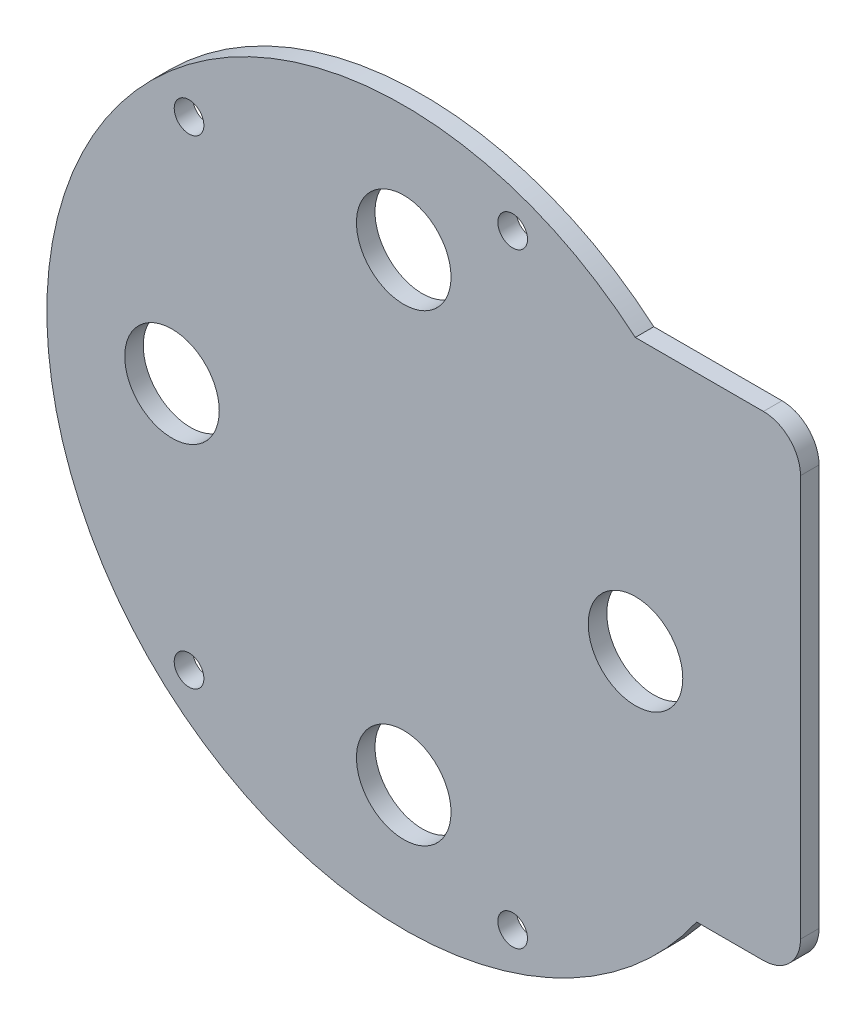
ISO-10303-21;
HEADER;
FILE_DESCRIPTION(('STEP AP214'),'2;1');
FILE_NAME('part.step','',(''),(''),'','','');
FILE_SCHEMA(('AUTOMOTIVE_DESIGN { 1 0 10303 214 1 1 1 1 }'));
ENDSEC;
DATA;
#1=APPLICATION_CONTEXT('core data for automotive mechanical design processes');
#2=APPLICATION_PROTOCOL_DEFINITION('international standard','automotive_design',2000,#1);
#3=PRODUCT_CONTEXT('',#1,'mechanical');
#4=PRODUCT('Part','Part','',(#3));
#5=PRODUCT_RELATED_PRODUCT_CATEGORY('part','',(#4));
#6=PRODUCT_DEFINITION_FORMATION('','',#4);
#7=PRODUCT_DEFINITION_CONTEXT('part definition',#1,'design');
#8=PRODUCT_DEFINITION('design','',#6,#7);
#9=PRODUCT_DEFINITION_SHAPE('','',#8);
#10=(LENGTH_UNIT() NAMED_UNIT(*) SI_UNIT(.MILLI.,.METRE.));
#11=(NAMED_UNIT(*) PLANE_ANGLE_UNIT() SI_UNIT($,.RADIAN.));
#12=(NAMED_UNIT(*) SI_UNIT($,.STERADIAN.) SOLID_ANGLE_UNIT());
#13=UNCERTAINTY_MEASURE_WITH_UNIT(LENGTH_MEASURE(1.E-05),#10,'distance_accuracy_value','');
#14=(GEOMETRIC_REPRESENTATION_CONTEXT(3) GLOBAL_UNCERTAINTY_ASSIGNED_CONTEXT((#13)) GLOBAL_UNIT_ASSIGNED_CONTEXT((#10,
#11,#12)) REPRESENTATION_CONTEXT('',''));
#15=CARTESIAN_POINT('',(0.,0.,0.));
#16=DIRECTION('',(0.,0.,1.));
#17=DIRECTION('',(1.,0.,0.));
#18=AXIS2_PLACEMENT_3D('',#15,#16,#17);
#19=CARTESIAN_POINT('',(0.,0.,2.));
#20=DIRECTION('',(0.,0.,1.));
#21=DIRECTION('',(1.,0.,0.));
#22=AXIS2_PLACEMENT_3D('',#19,#20,#21);
#23=PLANE('',#22);
#24=CARTESIAN_POINT('',(0.,25.,2.));
#25=DIRECTION('',(0.,0.,1.));
#26=DIRECTION('',(1.,0.,0.));
#27=AXIS2_PLACEMENT_3D('',#24,#25,#26);
#28=CIRCLE('',#27,5.1);
#29=CARTESIAN_POINT('',(5.09999999999999,25.,2.));
#30=VERTEX_POINT('',#29);
#31=EDGE_CURVE('E179',#30,#30,#28,.T.);
#32=ORIENTED_EDGE('',*,*,#31,.F.);
#33=EDGE_LOOP('',(#32));
#34=FACE_BOUND('',#33,.T.);
#35=CARTESIAN_POINT('',(0.,-25.,2.));
#36=DIRECTION('',(0.,0.,1.));
#37=DIRECTION('',(1.,0.,0.));
#38=AXIS2_PLACEMENT_3D('',#35,#36,#37);
#39=CIRCLE('',#38,5.1);
#40=CARTESIAN_POINT('',(5.10000000000001,-25.,2.));
#41=VERTEX_POINT('',#40);
#42=EDGE_CURVE('E167',#41,#41,#39,.T.);
#43=ORIENTED_EDGE('',*,*,#42,.F.);
#44=EDGE_LOOP('',(#43));
#45=FACE_BOUND('',#44,.T.);
#46=CARTESIAN_POINT('',(11.7502127640311,32.65,2.));
#47=DIRECTION('',(0.,0.,1.));
#48=DIRECTION('',(-1.,0.,0.));
#49=AXIS2_PLACEMENT_3D('',#46,#47,#48);
#50=CIRCLE('',#49,1.6);
#51=CARTESIAN_POINT('',(10.1502127640311,32.65,2.));
#52=VERTEX_POINT('',#51);
#53=EDGE_CURVE('E155',#52,#52,#50,.T.);
#54=ORIENTED_EDGE('',*,*,#53,.F.);
#55=EDGE_LOOP('',(#54));
#56=FACE_BOUND('',#55,.T.);
#57=CARTESIAN_POINT('',(-23.1599740932498,-25.84,2.));
#58=DIRECTION('',(0.,0.,1.));
#59=DIRECTION('',(1.,0.,0.));
#60=AXIS2_PLACEMENT_3D('',#57,#58,#59);
#61=CIRCLE('',#60,1.6);
#62=CARTESIAN_POINT('',(-21.5599740932498,-25.84,2.));
#63=VERTEX_POINT('',#62);
#64=EDGE_CURVE('E143',#63,#63,#61,.T.);
#65=ORIENTED_EDGE('',*,*,#64,.F.);
#66=EDGE_LOOP('',(#65));
#67=FACE_BOUND('',#66,.T.);
#68=DIRECTION('',(0.,1.,0.));
#69=VECTOR('',#68,1.);
#70=CARTESIAN_POINT('',(42.8,29.3,2.));
#71=LINE('',#70,#69);
#72=CARTESIAN_POINT('',(42.8,-18.,2.));
#73=VERTEX_POINT('',#72);
#74=CARTESIAN_POINT('',(42.8,25.3,2.));
#75=VERTEX_POINT('',#74);
#76=EDGE_CURVE('E92',#73,#75,#71,.T.);
#77=ORIENTED_EDGE('',*,*,#76,.T.);
#78=CARTESIAN_POINT('',(38.8,25.3,2.));
#79=DIRECTION('',(0.,0.,1.));
#80=DIRECTION('',(1.,0.,0.));
#81=AXIS2_PLACEMENT_3D('',#78,#79,#80);
#82=CIRCLE('',#81,4.);
#83=CARTESIAN_POINT('',(38.8,29.3,2.));
#84=VERTEX_POINT('',#83);
#85=EDGE_CURVE('E40',#75,#84,#82,.T.);
#86=ORIENTED_EDGE('',*,*,#85,.T.);
#87=DIRECTION('',(-1.,0.,0.));
#88=VECTOR('',#87,1.);
#89=CARTESIAN_POINT('',(24.9751876869825,29.3,2.));
#90=LINE('',#89,#88);
#91=CARTESIAN_POINT('',(24.9751876869825,29.3,2.));
#92=VERTEX_POINT('',#91);
#93=EDGE_CURVE('E98',#84,#92,#90,.T.);
#94=ORIENTED_EDGE('',*,*,#93,.T.);
#95=CARTESIAN_POINT('',(0.,0.,2.));
#96=DIRECTION('',(0.,0.,1.));
#97=DIRECTION('',(1.,0.,0.));
#98=AXIS2_PLACEMENT_3D('',#95,#96,#97);
#99=CIRCLE('',#98,38.5);
#100=CARTESIAN_POINT('',(31.5950945559592,-22.,2.));
#101=VERTEX_POINT('',#100);
#102=EDGE_CURVE('E93',#92,#101,#99,.T.);
#103=ORIENTED_EDGE('',*,*,#102,.T.);
#104=DIRECTION('',(1.,0.,0.));
#105=VECTOR('',#104,1.);
#106=CARTESIAN_POINT('',(42.8,-22.,2.));
#107=LINE('',#106,#105);
#108=CARTESIAN_POINT('',(38.8,-22.,2.));
#109=VERTEX_POINT('',#108);
#110=EDGE_CURVE('E84',#101,#109,#107,.T.);
#111=ORIENTED_EDGE('',*,*,#110,.T.);
#112=CARTESIAN_POINT('',(38.8,-18.,2.));
#113=DIRECTION('',(0.,0.,1.));
#114=DIRECTION('',(1.,0.,0.));
#115=AXIS2_PLACEMENT_3D('',#112,#113,#114);
#116=CIRCLE('',#115,4.);
#117=EDGE_CURVE('E123',#109,#73,#116,.T.);
#118=ORIENTED_EDGE('',*,*,#117,.T.);
#119=EDGE_LOOP('',(#77,#86,#94,#103,#111,#118));
#120=FACE_BOUND('',#119,.T.);
#121=CARTESIAN_POINT('',(11.7502127640311,-32.65,2.));
#122=DIRECTION('',(0.,0.,1.));
#123=DIRECTION('',(1.,0.,0.));
#124=AXIS2_PLACEMENT_3D('',#121,#122,#123);
#125=CIRCLE('',#124,1.6);
#126=CARTESIAN_POINT('',(13.3502127640311,-32.65,2.));
#127=VERTEX_POINT('',#126);
#128=EDGE_CURVE('E149',#127,#127,#125,.T.);
#129=ORIENTED_EDGE('',*,*,#128,.F.);
#130=EDGE_LOOP('',(#129));
#131=FACE_BOUND('',#130,.T.);
#132=CARTESIAN_POINT('',(-23.1599740932498,25.84,2.));
#133=DIRECTION('',(0.,0.,1.));
#134=DIRECTION('',(-1.,0.,0.));
#135=AXIS2_PLACEMENT_3D('',#132,#133,#134);
#136=CIRCLE('',#135,1.6);
#137=CARTESIAN_POINT('',(-24.7599740932498,25.84,2.));
#138=VERTEX_POINT('',#137);
#139=EDGE_CURVE('E161',#138,#138,#136,.T.);
#140=ORIENTED_EDGE('',*,*,#139,.F.);
#141=EDGE_LOOP('',(#140));
#142=FACE_BOUND('',#141,.T.);
#143=CARTESIAN_POINT('',(-25.,0.,2.));
#144=DIRECTION('',(0.,0.,1.));
#145=DIRECTION('',(1.,0.,0.));
#146=AXIS2_PLACEMENT_3D('',#143,#144,#145);
#147=CIRCLE('',#146,5.1);
#148=CARTESIAN_POINT('',(-19.9,0.,2.));
#149=VERTEX_POINT('',#148);
#150=EDGE_CURVE('E173',#149,#149,#147,.T.);
#151=ORIENTED_EDGE('',*,*,#150,.F.);
#152=EDGE_LOOP('',(#151));
#153=FACE_BOUND('',#152,.T.);
#154=CARTESIAN_POINT('',(25.,0.,2.));
#155=DIRECTION('',(0.,0.,1.));
#156=DIRECTION('',(1.,0.,0.));
#157=AXIS2_PLACEMENT_3D('',#154,#155,#156);
#158=CIRCLE('',#157,5.1);
#159=CARTESIAN_POINT('',(30.1,0.,2.));
#160=VERTEX_POINT('',#159);
#161=EDGE_CURVE('E185',#160,#160,#158,.T.);
#162=ORIENTED_EDGE('',*,*,#161,.F.);
#163=EDGE_LOOP('',(#162));
#164=FACE_BOUND('',#163,.T.);
#165=ADVANCED_FACE('F32',(#34,#45,#56,#67,#120,#131,#142,#153,#164),#23,.T.);
#166=CARTESIAN_POINT('',(0.,0.,0.));
#167=DIRECTION('',(0.,0.,1.));
#168=DIRECTION('',(1.,0.,0.));
#169=AXIS2_PLACEMENT_3D('',#166,#167,#168);
#170=PLANE('',#169);
#171=CARTESIAN_POINT('',(0.,25.,0.));
#172=DIRECTION('',(0.,0.,1.));
#173=DIRECTION('',(1.,0.,0.));
#174=AXIS2_PLACEMENT_3D('',#171,#172,#173);
#175=CIRCLE('',#174,5.1);
#176=CARTESIAN_POINT('',(5.09999999999999,25.,0.));
#177=VERTEX_POINT('',#176);
#178=EDGE_CURVE('E182',#177,#177,#175,.T.);
#179=ORIENTED_EDGE('',*,*,#178,.T.);
#180=EDGE_LOOP('',(#179));
#181=FACE_BOUND('',#180,.T.);
#182=CARTESIAN_POINT('',(0.,-25.,0.));
#183=DIRECTION('',(0.,0.,1.));
#184=DIRECTION('',(1.,0.,0.));
#185=AXIS2_PLACEMENT_3D('',#182,#183,#184);
#186=CIRCLE('',#185,5.1);
#187=CARTESIAN_POINT('',(5.10000000000001,-25.,0.));
#188=VERTEX_POINT('',#187);
#189=EDGE_CURVE('E170',#188,#188,#186,.T.);
#190=ORIENTED_EDGE('',*,*,#189,.T.);
#191=EDGE_LOOP('',(#190));
#192=FACE_BOUND('',#191,.T.);
#193=CARTESIAN_POINT('',(11.7502127640311,32.65,0.));
#194=DIRECTION('',(0.,0.,1.));
#195=DIRECTION('',(-1.,0.,0.));
#196=AXIS2_PLACEMENT_3D('',#193,#194,#195);
#197=CIRCLE('',#196,1.6);
#198=CARTESIAN_POINT('',(10.1502127640311,32.65,0.));
#199=VERTEX_POINT('',#198);
#200=EDGE_CURVE('E158',#199,#199,#197,.T.);
#201=ORIENTED_EDGE('',*,*,#200,.T.);
#202=EDGE_LOOP('',(#201));
#203=FACE_BOUND('',#202,.T.);
#204=CARTESIAN_POINT('',(-23.1599740932498,-25.84,0.));
#205=DIRECTION('',(0.,0.,1.));
#206=DIRECTION('',(1.,0.,0.));
#207=AXIS2_PLACEMENT_3D('',#204,#205,#206);
#208=CIRCLE('',#207,1.6);
#209=CARTESIAN_POINT('',(-21.5599740932498,-25.84,0.));
#210=VERTEX_POINT('',#209);
#211=EDGE_CURVE('E146',#210,#210,#208,.T.);
#212=ORIENTED_EDGE('',*,*,#211,.T.);
#213=EDGE_LOOP('',(#212));
#214=FACE_BOUND('',#213,.T.);
#215=DIRECTION('',(-1.,0.,0.));
#216=VECTOR('',#215,1.);
#217=CARTESIAN_POINT('',(24.9751876869825,29.3,0.));
#218=LINE('',#217,#216);
#219=CARTESIAN_POINT('',(38.8,29.3,0.));
#220=VERTEX_POINT('',#219);
#221=CARTESIAN_POINT('',(24.9751876869825,29.3,0.));
#222=VERTEX_POINT('',#221);
#223=EDGE_CURVE('E102',#220,#222,#218,.T.);
#224=ORIENTED_EDGE('',*,*,#223,.F.);
#225=CARTESIAN_POINT('',(38.8,25.3,0.));
#226=DIRECTION('',(0.,0.,1.));
#227=DIRECTION('',(1.,0.,0.));
#228=AXIS2_PLACEMENT_3D('',#225,#226,#227);
#229=CIRCLE('',#228,4.);
#230=CARTESIAN_POINT('',(42.8,25.3,0.));
#231=VERTEX_POINT('',#230);
#232=EDGE_CURVE('E117',#220,#231,#229,.F.);
#233=ORIENTED_EDGE('',*,*,#232,.T.);
#234=DIRECTION('',(0.,1.,0.));
#235=VECTOR('',#234,1.);
#236=CARTESIAN_POINT('',(42.8,29.3,0.));
#237=LINE('',#236,#235);
#238=CARTESIAN_POINT('',(42.8,-18.,0.));
#239=VERTEX_POINT('',#238);
#240=EDGE_CURVE('E136',#239,#231,#237,.T.);
#241=ORIENTED_EDGE('',*,*,#240,.F.);
#242=CARTESIAN_POINT('',(38.8,-18.,0.));
#243=DIRECTION('',(0.,0.,1.));
#244=DIRECTION('',(1.,0.,0.));
#245=AXIS2_PLACEMENT_3D('',#242,#243,#244);
#246=CIRCLE('',#245,4.);
#247=CARTESIAN_POINT('',(38.8,-22.,0.));
#248=VERTEX_POINT('',#247);
#249=EDGE_CURVE('E111',#239,#248,#246,.F.);
#250=ORIENTED_EDGE('',*,*,#249,.T.);
#251=DIRECTION('',(1.,0.,0.));
#252=VECTOR('',#251,1.);
#253=CARTESIAN_POINT('',(42.8,-22.,0.));
#254=LINE('',#253,#252);
#255=CARTESIAN_POINT('',(31.5950945559592,-22.,0.));
#256=VERTEX_POINT('',#255);
#257=EDGE_CURVE('E139',#256,#248,#254,.T.);
#258=ORIENTED_EDGE('',*,*,#257,.F.);
#259=CARTESIAN_POINT('',(0.,0.,0.));
#260=DIRECTION('',(0.,0.,1.));
#261=DIRECTION('',(1.,0.,0.));
#262=AXIS2_PLACEMENT_3D('',#259,#260,#261);
#263=CIRCLE('',#262,38.5);
#264=EDGE_CURVE('E106',#222,#256,#263,.T.);
#265=ORIENTED_EDGE('',*,*,#264,.F.);
#266=EDGE_LOOP('',(#224,#233,#241,#250,#258,#265));
#267=FACE_BOUND('',#266,.T.);
#268=CARTESIAN_POINT('',(11.7502127640311,-32.65,0.));
#269=DIRECTION('',(0.,0.,1.));
#270=DIRECTION('',(1.,0.,0.));
#271=AXIS2_PLACEMENT_3D('',#268,#269,#270);
#272=CIRCLE('',#271,1.6);
#273=CARTESIAN_POINT('',(13.3502127640311,-32.65,0.));
#274=VERTEX_POINT('',#273);
#275=EDGE_CURVE('E152',#274,#274,#272,.T.);
#276=ORIENTED_EDGE('',*,*,#275,.T.);
#277=EDGE_LOOP('',(#276));
#278=FACE_BOUND('',#277,.T.);
#279=CARTESIAN_POINT('',(-23.1599740932498,25.84,0.));
#280=DIRECTION('',(0.,0.,1.));
#281=DIRECTION('',(-1.,0.,0.));
#282=AXIS2_PLACEMENT_3D('',#279,#280,#281);
#283=CIRCLE('',#282,1.6);
#284=CARTESIAN_POINT('',(-24.7599740932498,25.84,0.));
#285=VERTEX_POINT('',#284);
#286=EDGE_CURVE('E164',#285,#285,#283,.T.);
#287=ORIENTED_EDGE('',*,*,#286,.T.);
#288=EDGE_LOOP('',(#287));
#289=FACE_BOUND('',#288,.T.);
#290=CARTESIAN_POINT('',(-25.,0.,0.));
#291=DIRECTION('',(0.,0.,1.));
#292=DIRECTION('',(1.,0.,0.));
#293=AXIS2_PLACEMENT_3D('',#290,#291,#292);
#294=CIRCLE('',#293,5.1);
#295=CARTESIAN_POINT('',(-19.9,0.,0.));
#296=VERTEX_POINT('',#295);
#297=EDGE_CURVE('E176',#296,#296,#294,.T.);
#298=ORIENTED_EDGE('',*,*,#297,.T.);
#299=EDGE_LOOP('',(#298));
#300=FACE_BOUND('',#299,.T.);
#301=CARTESIAN_POINT('',(25.,0.,0.));
#302=DIRECTION('',(0.,0.,1.));
#303=DIRECTION('',(1.,0.,0.));
#304=AXIS2_PLACEMENT_3D('',#301,#302,#303);
#305=CIRCLE('',#304,5.1);
#306=CARTESIAN_POINT('',(30.1,0.,0.));
#307=VERTEX_POINT('',#306);
#308=EDGE_CURVE('E188',#307,#307,#305,.T.);
#309=ORIENTED_EDGE('',*,*,#308,.T.);
#310=EDGE_LOOP('',(#309));
#311=FACE_BOUND('',#310,.T.);
#312=ADVANCED_FACE('F134',(#181,#192,#203,#214,#267,#278,#289,#300,#311),#170,.F.);
#313=CARTESIAN_POINT('',(0.,0.,2.));
#314=DIRECTION('',(0.,0.,-1.));
#315=DIRECTION('',(-1.,0.,0.));
#316=AXIS2_PLACEMENT_3D('',#313,#314,#315);
#317=CYLINDRICAL_SURFACE('',#316,38.5);
#318=ORIENTED_EDGE('',*,*,#264,.T.);
#319=DIRECTION('',(0.,0.,-1.));
#320=VECTOR('',#319,1.);
#321=CARTESIAN_POINT('',(31.5950945559592,-22.,2.));
#322=LINE('',#321,#320);
#323=EDGE_CURVE('E88',#101,#256,#322,.T.);
#324=ORIENTED_EDGE('',*,*,#323,.F.);
#325=ORIENTED_EDGE('',*,*,#102,.F.);
#326=DIRECTION('',(0.,0.,-1.));
#327=VECTOR('',#326,1.);
#328=CARTESIAN_POINT('',(24.9751876869825,29.3,2.));
#329=LINE('',#328,#327);
#330=EDGE_CURVE('E108',#92,#222,#329,.T.);
#331=ORIENTED_EDGE('',*,*,#330,.T.);
#332=EDGE_LOOP('',(#318,#324,#325,#331));
#333=FACE_BOUND('',#332,.T.);
#334=ADVANCED_FACE('F104',(#333),#317,.T.);
#335=CARTESIAN_POINT('',(42.8,-22.,2.));
#336=DIRECTION('',(0.,1.,0.));
#337=DIRECTION('',(-1.,0.,0.));
#338=AXIS2_PLACEMENT_3D('',#335,#336,#337);
#339=PLANE('',#338);
#340=ORIENTED_EDGE('',*,*,#257,.T.);
#341=DIRECTION('',(0.,0.,-1.));
#342=VECTOR('',#341,1.);
#343=CARTESIAN_POINT('',(38.8,-22.,2.));
#344=LINE('',#343,#342);
#345=EDGE_CURVE('E11',#248,#109,#344,.F.);
#346=ORIENTED_EDGE('',*,*,#345,.T.);
#347=ORIENTED_EDGE('',*,*,#110,.F.);
#348=ORIENTED_EDGE('',*,*,#323,.T.);
#349=EDGE_LOOP('',(#340,#346,#347,#348));
#350=FACE_BOUND('',#349,.T.);
#351=ADVANCED_FACE('F86',(#350),#339,.F.);
#352=CARTESIAN_POINT('',(42.8,29.3,2.));
#353=DIRECTION('',(-1.,0.,0.));
#354=DIRECTION('',(0.,-1.,0.));
#355=AXIS2_PLACEMENT_3D('',#352,#353,#354);
#356=PLANE('',#355);
#357=ORIENTED_EDGE('',*,*,#240,.T.);
#358=DIRECTION('',(0.,0.,-1.));
#359=VECTOR('',#358,1.);
#360=CARTESIAN_POINT('',(42.8,25.3,2.));
#361=LINE('',#360,#359);
#362=EDGE_CURVE('E53',#231,#75,#361,.F.);
#363=ORIENTED_EDGE('',*,*,#362,.T.);
#364=ORIENTED_EDGE('',*,*,#76,.F.);
#365=DIRECTION('',(0.,0.,-1.));
#366=VECTOR('',#365,1.);
#367=CARTESIAN_POINT('',(42.8,-18.,2.));
#368=LINE('',#367,#366);
#369=EDGE_CURVE('E119',#73,#239,#368,.T.);
#370=ORIENTED_EDGE('',*,*,#369,.T.);
#371=EDGE_LOOP('',(#357,#363,#364,#370));
#372=FACE_BOUND('',#371,.T.);
#373=ADVANCED_FACE('F137',(#372),#356,.F.);
#374=CARTESIAN_POINT('',(24.9751876869825,29.3,2.));
#375=DIRECTION('',(0.,-1.,0.));
#376=DIRECTION('',(0.,0.,-1.));
#377=AXIS2_PLACEMENT_3D('',#374,#375,#376);
#378=PLANE('',#377);
#379=ORIENTED_EDGE('',*,*,#93,.F.);
#380=DIRECTION('',(0.,0.,-1.));
#381=VECTOR('',#380,1.);
#382=CARTESIAN_POINT('',(38.8,29.3,2.));
#383=LINE('',#382,#381);
#384=EDGE_CURVE('E107',#84,#220,#383,.T.);
#385=ORIENTED_EDGE('',*,*,#384,.T.);
#386=ORIENTED_EDGE('',*,*,#223,.T.);
#387=ORIENTED_EDGE('',*,*,#330,.F.);
#388=EDGE_LOOP('',(#379,#385,#386,#387));
#389=FACE_BOUND('',#388,.T.);
#390=ADVANCED_FACE('F128',(#389),#378,.F.);
#391=CARTESIAN_POINT('',(-23.1599740932498,-25.84,2.));
#392=DIRECTION('',(0.,0.,-1.));
#393=DIRECTION('',(-1.,0.,0.));
#394=AXIS2_PLACEMENT_3D('',#391,#392,#393);
#395=CYLINDRICAL_SURFACE('',#394,1.6);
#396=ORIENTED_EDGE('',*,*,#64,.T.);
#397=EDGE_LOOP('',(#396));
#398=FACE_BOUND('',#397,.T.);
#399=ORIENTED_EDGE('',*,*,#211,.F.);
#400=EDGE_LOOP('',(#399));
#401=FACE_BOUND('',#400,.T.);
#402=ADVANCED_FACE('F208',(#398,#401),#395,.F.);
#403=CARTESIAN_POINT('',(11.7502127640311,-32.65,2.));
#404=DIRECTION('',(0.,0.,-1.));
#405=DIRECTION('',(-1.,0.,0.));
#406=AXIS2_PLACEMENT_3D('',#403,#404,#405);
#407=CYLINDRICAL_SURFACE('',#406,1.6);
#408=ORIENTED_EDGE('',*,*,#128,.T.);
#409=EDGE_LOOP('',(#408));
#410=FACE_BOUND('',#409,.T.);
#411=ORIENTED_EDGE('',*,*,#275,.F.);
#412=EDGE_LOOP('',(#411));
#413=FACE_BOUND('',#412,.T.);
#414=ADVANCED_FACE('F246',(#410,#413),#407,.F.);
#415=CARTESIAN_POINT('',(11.7502127640311,32.65,2.));
#416=DIRECTION('',(0.,0.,-1.));
#417=DIRECTION('',(-1.,0.,0.));
#418=AXIS2_PLACEMENT_3D('',#415,#416,#417);
#419=CYLINDRICAL_SURFACE('',#418,1.6);
#420=ORIENTED_EDGE('',*,*,#53,.T.);
#421=EDGE_LOOP('',(#420));
#422=FACE_BOUND('',#421,.T.);
#423=ORIENTED_EDGE('',*,*,#200,.F.);
#424=EDGE_LOOP('',(#423));
#425=FACE_BOUND('',#424,.T.);
#426=ADVANCED_FACE('F243',(#422,#425),#419,.F.);
#427=CARTESIAN_POINT('',(-23.1599740932498,25.84,2.));
#428=DIRECTION('',(0.,0.,-1.));
#429=DIRECTION('',(-1.,0.,0.));
#430=AXIS2_PLACEMENT_3D('',#427,#428,#429);
#431=CYLINDRICAL_SURFACE('',#430,1.6);
#432=ORIENTED_EDGE('',*,*,#139,.T.);
#433=EDGE_LOOP('',(#432));
#434=FACE_BOUND('',#433,.T.);
#435=ORIENTED_EDGE('',*,*,#286,.F.);
#436=EDGE_LOOP('',(#435));
#437=FACE_BOUND('',#436,.T.);
#438=ADVANCED_FACE('F239',(#434,#437),#431,.F.);
#439=CARTESIAN_POINT('',(0.,-25.,2.));
#440=DIRECTION('',(0.,0.,-1.));
#441=DIRECTION('',(-1.,0.,0.));
#442=AXIS2_PLACEMENT_3D('',#439,#440,#441);
#443=CYLINDRICAL_SURFACE('',#442,5.1);
#444=ORIENTED_EDGE('',*,*,#42,.T.);
#445=EDGE_LOOP('',(#444));
#446=FACE_BOUND('',#445,.T.);
#447=ORIENTED_EDGE('',*,*,#189,.F.);
#448=EDGE_LOOP('',(#447));
#449=FACE_BOUND('',#448,.T.);
#450=ADVANCED_FACE('F235',(#446,#449),#443,.F.);
#451=CARTESIAN_POINT('',(-25.,0.,2.));
#452=DIRECTION('',(0.,0.,-1.));
#453=DIRECTION('',(-1.,0.,0.));
#454=AXIS2_PLACEMENT_3D('',#451,#452,#453);
#455=CYLINDRICAL_SURFACE('',#454,5.1);
#456=ORIENTED_EDGE('',*,*,#150,.T.);
#457=EDGE_LOOP('',(#456));
#458=FACE_BOUND('',#457,.T.);
#459=ORIENTED_EDGE('',*,*,#297,.F.);
#460=EDGE_LOOP('',(#459));
#461=FACE_BOUND('',#460,.T.);
#462=ADVANCED_FACE('F229',(#458,#461),#455,.F.);
#463=CARTESIAN_POINT('',(0.,25.,2.));
#464=DIRECTION('',(0.,0.,-1.));
#465=DIRECTION('',(-1.,0.,0.));
#466=AXIS2_PLACEMENT_3D('',#463,#464,#465);
#467=CYLINDRICAL_SURFACE('',#466,5.1);
#468=ORIENTED_EDGE('',*,*,#31,.T.);
#469=EDGE_LOOP('',(#468));
#470=FACE_BOUND('',#469,.T.);
#471=ORIENTED_EDGE('',*,*,#178,.F.);
#472=EDGE_LOOP('',(#471));
#473=FACE_BOUND('',#472,.T.);
#474=ADVANCED_FACE('F224',(#470,#473),#467,.F.);
#475=CARTESIAN_POINT('',(25.,0.,2.));
#476=DIRECTION('',(0.,0.,-1.));
#477=DIRECTION('',(-1.,0.,0.));
#478=AXIS2_PLACEMENT_3D('',#475,#476,#477);
#479=CYLINDRICAL_SURFACE('',#478,5.1);
#480=ORIENTED_EDGE('',*,*,#161,.T.);
#481=EDGE_LOOP('',(#480));
#482=FACE_BOUND('',#481,.T.);
#483=ORIENTED_EDGE('',*,*,#308,.F.);
#484=EDGE_LOOP('',(#483));
#485=FACE_BOUND('',#484,.T.);
#486=ADVANCED_FACE('F194',(#482,#485),#479,.F.);
#487=CARTESIAN_POINT('',(38.8,25.3,2.));
#488=DIRECTION('',(0.,0.,-1.));
#489=DIRECTION('',(-1.,0.,0.));
#490=AXIS2_PLACEMENT_3D('',#487,#488,#489);
#491=CYLINDRICAL_SURFACE('',#490,4.);
#492=ORIENTED_EDGE('',*,*,#85,.F.);
#493=ORIENTED_EDGE('',*,*,#362,.F.);
#494=ORIENTED_EDGE('',*,*,#232,.F.);
#495=ORIENTED_EDGE('',*,*,#384,.F.);
#496=EDGE_LOOP('',(#492,#493,#494,#495));
#497=FACE_BOUND('',#496,.T.);
#498=ADVANCED_FACE('F131',(#497),#491,.T.);
#499=CARTESIAN_POINT('',(38.8,-18.,2.));
#500=DIRECTION('',(0.,0.,-1.));
#501=DIRECTION('',(-1.,0.,0.));
#502=AXIS2_PLACEMENT_3D('',#499,#500,#501);
#503=CYLINDRICAL_SURFACE('',#502,4.);
#504=ORIENTED_EDGE('',*,*,#117,.F.);
#505=ORIENTED_EDGE('',*,*,#345,.F.);
#506=ORIENTED_EDGE('',*,*,#249,.F.);
#507=ORIENTED_EDGE('',*,*,#369,.F.);
#508=EDGE_LOOP('',(#504,#505,#506,#507));
#509=FACE_BOUND('',#508,.T.);
#510=ADVANCED_FACE('F34',(#509),#503,.T.);
#511=CLOSED_SHELL('',(#165,#312,#334,#351,#373,#390,#402,#414,#426,#438,#450,#462,#474,#486,
#498,#510));
#512=MANIFOLD_SOLID_BREP('B2',#511);
#513=ADVANCED_BREP_SHAPE_REPRESENTATION('',(#18,#512),#14);
#514=SHAPE_DEFINITION_REPRESENTATION(#9,#513);
ENDSEC;
END-ISO-10303-21;
